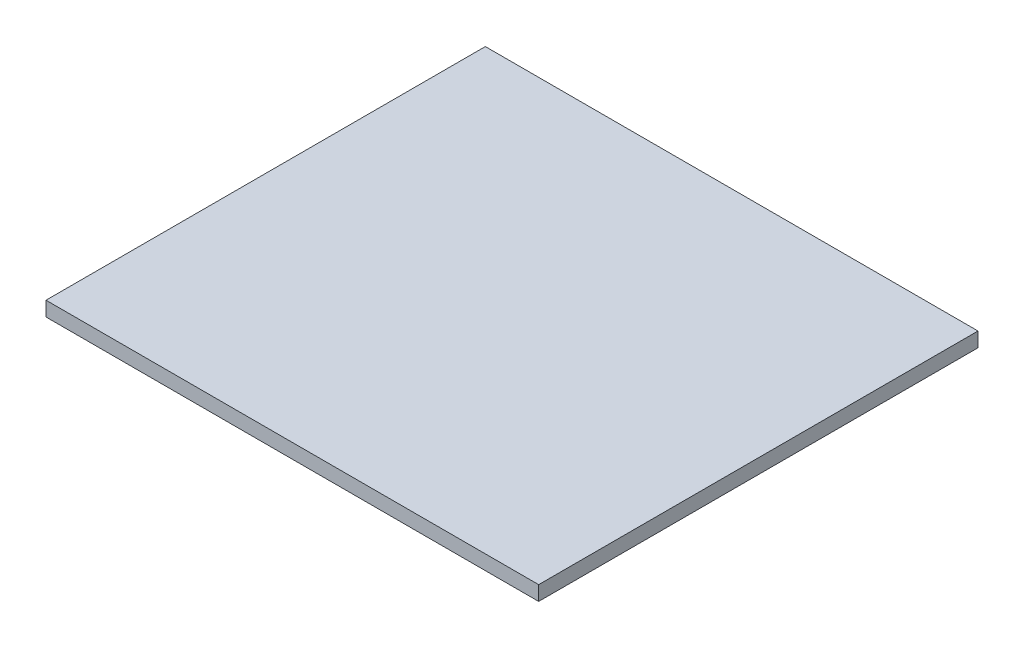
ISO-10303-21;
HEADER;
FILE_DESCRIPTION(('STEP AP214'),'2;1');
FILE_NAME('part.step','',(''),(''),'','','');
FILE_SCHEMA(('AUTOMOTIVE_DESIGN { 1 0 10303 214 1 1 1 1 }'));
ENDSEC;
DATA;
#1=APPLICATION_CONTEXT('core data for automotive mechanical design processes');
#2=APPLICATION_PROTOCOL_DEFINITION('international standard','automotive_design',2000,#1);
#3=PRODUCT_CONTEXT('',#1,'mechanical');
#4=PRODUCT('Part','Part','',(#3));
#5=PRODUCT_RELATED_PRODUCT_CATEGORY('part','',(#4));
#6=PRODUCT_DEFINITION_FORMATION('','',#4);
#7=PRODUCT_DEFINITION_CONTEXT('part definition',#1,'design');
#8=PRODUCT_DEFINITION('design','',#6,#7);
#9=PRODUCT_DEFINITION_SHAPE('','',#8);
#10=(LENGTH_UNIT() NAMED_UNIT(*) SI_UNIT(.MILLI.,.METRE.));
#11=(NAMED_UNIT(*) PLANE_ANGLE_UNIT() SI_UNIT($,.RADIAN.));
#12=(NAMED_UNIT(*) SI_UNIT($,.STERADIAN.) SOLID_ANGLE_UNIT());
#13=UNCERTAINTY_MEASURE_WITH_UNIT(LENGTH_MEASURE(1.E-05),#10,'distance_accuracy_value','');
#14=(GEOMETRIC_REPRESENTATION_CONTEXT(3) GLOBAL_UNCERTAINTY_ASSIGNED_CONTEXT((#13)) GLOBAL_UNIT_ASSIGNED_CONTEXT((#10,
#11,#12)) REPRESENTATION_CONTEXT('',''));
#15=CARTESIAN_POINT('',(0.,0.,0.));
#16=DIRECTION('',(0.,0.,1.));
#17=DIRECTION('',(1.,0.,0.));
#18=AXIS2_PLACEMENT_3D('',#15,#16,#17);
#19=CARTESIAN_POINT('',(461.9,1.9,411.9));
#20=DIRECTION('',(-1.,0.,0.));
#21=DIRECTION('',(0.,0.,1.));
#22=AXIS2_PLACEMENT_3D('',#19,#20,#21);
#23=PLANE('',#22);
#24=DIRECTION('',(0.,-1.,0.));
#25=VECTOR('',#24,1.);
#26=CARTESIAN_POINT('',(461.9,1.9,411.9));
#27=LINE('',#26,#25);
#28=CARTESIAN_POINT('',(461.9,1.9,411.9));
#29=VERTEX_POINT('',#28);
#30=CARTESIAN_POINT('',(461.9,-25.4,411.9));
#31=VERTEX_POINT('',#30);
#32=EDGE_CURVE('E154',#29,#31,#27,.T.);
#33=ORIENTED_EDGE('',*,*,#32,.T.);
#34=DIRECTION('',(0.,0.,1.));
#35=VECTOR('',#34,1.);
#36=CARTESIAN_POINT('',(461.9,-25.4,411.9));
#37=LINE('',#36,#35);
#38=CARTESIAN_POINT('',(461.9,-25.4,-411.9));
#39=VERTEX_POINT('',#38);
#40=EDGE_CURVE('E139',#39,#31,#37,.T.);
#41=ORIENTED_EDGE('',*,*,#40,.F.);
#42=DIRECTION('',(0.,-1.,0.));
#43=VECTOR('',#42,1.);
#44=CARTESIAN_POINT('',(461.9,1.9,-411.9));
#45=LINE('',#44,#43);
#46=CARTESIAN_POINT('',(461.9,1.9,-411.9));
#47=VERTEX_POINT('',#46);
#48=EDGE_CURVE('E11',#47,#39,#45,.T.);
#49=ORIENTED_EDGE('',*,*,#48,.F.);
#50=DIRECTION('',(0.,0.,-1.));
#51=VECTOR('',#50,1.);
#52=CARTESIAN_POINT('',(461.9,1.9,411.9));
#53=LINE('',#52,#51);
#54=EDGE_CURVE('E145',#29,#47,#53,.T.);
#55=ORIENTED_EDGE('',*,*,#54,.F.);
#56=EDGE_LOOP('',(#33,#41,#49,#55));
#57=FACE_BOUND('',#56,.T.);
#58=ADVANCED_FACE('F35',(#57),#23,.F.);
#59=CARTESIAN_POINT('',(-461.9,1.9,-411.9));
#60=DIRECTION('',(0.,0.,1.));
#61=DIRECTION('',(1.,0.,0.));
#62=AXIS2_PLACEMENT_3D('',#59,#60,#61);
#63=PLANE('',#62);
#64=ORIENTED_EDGE('',*,*,#48,.T.);
#65=DIRECTION('',(1.,0.,0.));
#66=VECTOR('',#65,1.);
#67=CARTESIAN_POINT('',(-461.9,-25.4,-411.9));
#68=LINE('',#67,#66);
#69=CARTESIAN_POINT('',(-461.9,-25.4,-411.9));
#70=VERTEX_POINT('',#69);
#71=EDGE_CURVE('E136',#70,#39,#68,.T.);
#72=ORIENTED_EDGE('',*,*,#71,.F.);
#73=DIRECTION('',(0.,-1.,0.));
#74=VECTOR('',#73,1.);
#75=CARTESIAN_POINT('',(-461.9,1.9,-411.9));
#76=LINE('',#75,#74);
#77=CARTESIAN_POINT('',(-461.9,1.9,-411.9));
#78=VERTEX_POINT('',#77);
#79=EDGE_CURVE('E42',#78,#70,#76,.T.);
#80=ORIENTED_EDGE('',*,*,#79,.F.);
#81=DIRECTION('',(-1.,0.,0.));
#82=VECTOR('',#81,1.);
#83=CARTESIAN_POINT('',(-461.9,1.9,-411.9));
#84=LINE('',#83,#82);
#85=EDGE_CURVE('E148',#47,#78,#84,.T.);
#86=ORIENTED_EDGE('',*,*,#85,.F.);
#87=EDGE_LOOP('',(#64,#72,#80,#86));
#88=FACE_BOUND('',#87,.T.);
#89=ADVANCED_FACE('F165',(#88),#63,.F.);
#90=CARTESIAN_POINT('',(-461.9,1.9,411.9));
#91=DIRECTION('',(1.,0.,0.));
#92=DIRECTION('',(0.,0.,-1.));
#93=AXIS2_PLACEMENT_3D('',#90,#91,#92);
#94=PLANE('',#93);
#95=ORIENTED_EDGE('',*,*,#79,.T.);
#96=DIRECTION('',(0.,0.,-1.));
#97=VECTOR('',#96,1.);
#98=CARTESIAN_POINT('',(-461.9,-25.4,411.9));
#99=LINE('',#98,#97);
#100=CARTESIAN_POINT('',(-461.9,-25.4,411.9));
#101=VERTEX_POINT('',#100);
#102=EDGE_CURVE('E112',#101,#70,#99,.T.);
#103=ORIENTED_EDGE('',*,*,#102,.F.);
#104=DIRECTION('',(0.,-1.,0.));
#105=VECTOR('',#104,1.);
#106=CARTESIAN_POINT('',(-461.9,1.9,411.9));
#107=LINE('',#106,#105);
#108=CARTESIAN_POINT('',(-461.9,1.9,411.9));
#109=VERTEX_POINT('',#108);
#110=EDGE_CURVE('E156',#109,#101,#107,.T.);
#111=ORIENTED_EDGE('',*,*,#110,.F.);
#112=DIRECTION('',(0.,0.,1.));
#113=VECTOR('',#112,1.);
#114=CARTESIAN_POINT('',(-461.9,1.9,411.9));
#115=LINE('',#114,#113);
#116=EDGE_CURVE('E150',#78,#109,#115,.T.);
#117=ORIENTED_EDGE('',*,*,#116,.F.);
#118=EDGE_LOOP('',(#95,#103,#111,#117));
#119=FACE_BOUND('',#118,.T.);
#120=ADVANCED_FACE('F162',(#119),#94,.F.);
#121=CARTESIAN_POINT('',(-461.9,1.9,411.9));
#122=DIRECTION('',(0.,0.,-1.));
#123=DIRECTION('',(-1.,0.,0.));
#124=AXIS2_PLACEMENT_3D('',#121,#122,#123);
#125=PLANE('',#124);
#126=ORIENTED_EDGE('',*,*,#110,.T.);
#127=DIRECTION('',(-1.,0.,0.));
#128=VECTOR('',#127,1.);
#129=CARTESIAN_POINT('',(-461.9,-25.4,411.9));
#130=LINE('',#129,#128);
#131=EDGE_CURVE('E142',#31,#101,#130,.T.);
#132=ORIENTED_EDGE('',*,*,#131,.F.);
#133=ORIENTED_EDGE('',*,*,#32,.F.);
#134=DIRECTION('',(1.,0.,0.));
#135=VECTOR('',#134,1.);
#136=CARTESIAN_POINT('',(-461.9,1.9,411.9));
#137=LINE('',#136,#135);
#138=EDGE_CURVE('E152',#109,#29,#137,.T.);
#139=ORIENTED_EDGE('',*,*,#138,.F.);
#140=EDGE_LOOP('',(#126,#132,#133,#139));
#141=FACE_BOUND('',#140,.T.);
#142=ADVANCED_FACE('F172',(#141),#125,.F.);
#143=CARTESIAN_POINT('',(0.,1.9,0.));
#144=DIRECTION('',(0.,-1.,0.));
#145=DIRECTION('',(0.,0.,-1.));
#146=AXIS2_PLACEMENT_3D('',#143,#144,#145);
#147=PLANE('',#146);
#148=ORIENTED_EDGE('',*,*,#54,.T.);
#149=ORIENTED_EDGE('',*,*,#85,.T.);
#150=ORIENTED_EDGE('',*,*,#116,.T.);
#151=ORIENTED_EDGE('',*,*,#138,.T.);
#152=EDGE_LOOP('',(#148,#149,#150,#151));
#153=FACE_BOUND('',#152,.T.);
#154=ADVANCED_FACE('F176',(#153),#147,.F.);
#155=CARTESIAN_POINT('',(0.,-25.4,0.));
#156=DIRECTION('',(0.,-1.,0.));
#157=DIRECTION('',(0.,0.,-1.));
#158=AXIS2_PLACEMENT_3D('',#155,#156,#157);
#159=PLANE('',#158);
#160=ORIENTED_EDGE('',*,*,#102,.T.);
#161=ORIENTED_EDGE('',*,*,#71,.T.);
#162=ORIENTED_EDGE('',*,*,#40,.T.);
#163=ORIENTED_EDGE('',*,*,#131,.T.);
#164=EDGE_LOOP('',(#160,#161,#162,#163));
#165=FACE_BOUND('',#164,.T.);
#166=DIRECTION('',(0.,0.,-1.));
#167=VECTOR('',#166,1.);
#168=CARTESIAN_POINT('',(-460.,-25.4,410.));
#169=LINE('',#168,#167);
#170=CARTESIAN_POINT('',(-460.,-25.4,410.));
#171=VERTEX_POINT('',#170);
#172=CARTESIAN_POINT('',(-460.,-25.4,-410.));
#173=VERTEX_POINT('',#172);
#174=EDGE_CURVE('E106',#171,#173,#169,.T.);
#175=ORIENTED_EDGE('',*,*,#174,.F.);
#176=DIRECTION('',(-1.,0.,0.));
#177=VECTOR('',#176,1.);
#178=CARTESIAN_POINT('',(-460.,-25.4,410.));
#179=LINE('',#178,#177);
#180=CARTESIAN_POINT('',(460.,-25.4,410.));
#181=VERTEX_POINT('',#180);
#182=EDGE_CURVE('E97',#181,#171,#179,.T.);
#183=ORIENTED_EDGE('',*,*,#182,.F.);
#184=DIRECTION('',(0.,0.,1.));
#185=VECTOR('',#184,1.);
#186=CARTESIAN_POINT('',(460.,-25.4,410.));
#187=LINE('',#186,#185);
#188=CARTESIAN_POINT('',(460.,-25.4,-410.));
#189=VERTEX_POINT('',#188);
#190=EDGE_CURVE('E120',#189,#181,#187,.T.);
#191=ORIENTED_EDGE('',*,*,#190,.F.);
#192=DIRECTION('',(1.,0.,0.));
#193=VECTOR('',#192,1.);
#194=CARTESIAN_POINT('',(-460.,-25.4,-410.));
#195=LINE('',#194,#193);
#196=EDGE_CURVE('E118',#173,#189,#195,.T.);
#197=ORIENTED_EDGE('',*,*,#196,.F.);
#198=EDGE_LOOP('',(#175,#183,#191,#197));
#199=FACE_BOUND('',#198,.T.);
#200=ADVANCED_FACE('F116',(#165,#199),#159,.T.);
#201=CARTESIAN_POINT('',(-460.,-25.4,410.));
#202=DIRECTION('',(0.,0.,-1.));
#203=DIRECTION('',(-1.,0.,0.));
#204=AXIS2_PLACEMENT_3D('',#201,#202,#203);
#205=PLANE('',#204);
#206=DIRECTION('',(-1.,0.,0.));
#207=VECTOR('',#206,1.);
#208=CARTESIAN_POINT('',(-460.,0.,410.));
#209=LINE('',#208,#207);
#210=CARTESIAN_POINT('',(460.,0.,410.));
#211=VERTEX_POINT('',#210);
#212=CARTESIAN_POINT('',(-460.,0.,410.));
#213=VERTEX_POINT('',#212);
#214=EDGE_CURVE('E49',#211,#213,#209,.T.);
#215=ORIENTED_EDGE('',*,*,#214,.F.);
#216=DIRECTION('',(0.,1.,0.));
#217=VECTOR('',#216,1.);
#218=CARTESIAN_POINT('',(460.,-25.4,410.));
#219=LINE('',#218,#217);
#220=EDGE_CURVE('E102',#181,#211,#219,.T.);
#221=ORIENTED_EDGE('',*,*,#220,.F.);
#222=ORIENTED_EDGE('',*,*,#182,.T.);
#223=DIRECTION('',(0.,1.,0.));
#224=VECTOR('',#223,1.);
#225=CARTESIAN_POINT('',(-460.,-25.4,410.));
#226=LINE('',#225,#224);
#227=EDGE_CURVE('E100',#171,#213,#226,.T.);
#228=ORIENTED_EDGE('',*,*,#227,.T.);
#229=EDGE_LOOP('',(#215,#221,#222,#228));
#230=FACE_BOUND('',#229,.T.);
#231=ADVANCED_FACE('F99',(#230),#205,.T.);
#232=CARTESIAN_POINT('',(-460.,-25.4,410.));
#233=DIRECTION('',(1.,0.,0.));
#234=DIRECTION('',(0.,0.,-1.));
#235=AXIS2_PLACEMENT_3D('',#232,#233,#234);
#236=PLANE('',#235);
#237=DIRECTION('',(0.,0.,-1.));
#238=VECTOR('',#237,1.);
#239=CARTESIAN_POINT('',(-460.,0.,410.));
#240=LINE('',#239,#238);
#241=CARTESIAN_POINT('',(-460.,0.,-410.));
#242=VERTEX_POINT('',#241);
#243=EDGE_CURVE('E53',#213,#242,#240,.T.);
#244=ORIENTED_EDGE('',*,*,#243,.F.);
#245=ORIENTED_EDGE('',*,*,#227,.F.);
#246=ORIENTED_EDGE('',*,*,#174,.T.);
#247=DIRECTION('',(0.,1.,0.));
#248=VECTOR('',#247,1.);
#249=CARTESIAN_POINT('',(-460.,-25.4,-410.));
#250=LINE('',#249,#248);
#251=EDGE_CURVE('E113',#173,#242,#250,.T.);
#252=ORIENTED_EDGE('',*,*,#251,.T.);
#253=EDGE_LOOP('',(#244,#245,#246,#252));
#254=FACE_BOUND('',#253,.T.);
#255=ADVANCED_FACE('F110',(#254),#236,.T.);
#256=CARTESIAN_POINT('',(-460.,-25.4,-410.));
#257=DIRECTION('',(0.,0.,1.));
#258=DIRECTION('',(1.,0.,0.));
#259=AXIS2_PLACEMENT_3D('',#256,#257,#258);
#260=PLANE('',#259);
#261=DIRECTION('',(1.,0.,0.));
#262=VECTOR('',#261,1.);
#263=CARTESIAN_POINT('',(-460.,0.,-410.));
#264=LINE('',#263,#262);
#265=CARTESIAN_POINT('',(460.,0.,-410.));
#266=VERTEX_POINT('',#265);
#267=EDGE_CURVE('E126',#242,#266,#264,.T.);
#268=ORIENTED_EDGE('',*,*,#267,.F.);
#269=ORIENTED_EDGE('',*,*,#251,.F.);
#270=ORIENTED_EDGE('',*,*,#196,.T.);
#271=DIRECTION('',(0.,1.,0.));
#272=VECTOR('',#271,1.);
#273=CARTESIAN_POINT('',(460.,-25.4,-410.));
#274=LINE('',#273,#272);
#275=EDGE_CURVE('E130',#189,#266,#274,.T.);
#276=ORIENTED_EDGE('',*,*,#275,.T.);
#277=EDGE_LOOP('',(#268,#269,#270,#276));
#278=FACE_BOUND('',#277,.T.);
#279=ADVANCED_FACE('F201',(#278),#260,.T.);
#280=CARTESIAN_POINT('',(460.,-25.4,410.));
#281=DIRECTION('',(-1.,0.,0.));
#282=DIRECTION('',(0.,0.,1.));
#283=AXIS2_PLACEMENT_3D('',#280,#281,#282);
#284=PLANE('',#283);
#285=DIRECTION('',(0.,0.,1.));
#286=VECTOR('',#285,1.);
#287=CARTESIAN_POINT('',(460.,0.,410.));
#288=LINE('',#287,#286);
#289=EDGE_CURVE('E107',#266,#211,#288,.T.);
#290=ORIENTED_EDGE('',*,*,#289,.F.);
#291=ORIENTED_EDGE('',*,*,#275,.F.);
#292=ORIENTED_EDGE('',*,*,#190,.T.);
#293=ORIENTED_EDGE('',*,*,#220,.T.);
#294=EDGE_LOOP('',(#290,#291,#292,#293));
#295=FACE_BOUND('',#294,.T.);
#296=ADVANCED_FACE('F192',(#295),#284,.T.);
#297=CARTESIAN_POINT('',(0.,0.,0.));
#298=DIRECTION('',(0.,-1.,0.));
#299=DIRECTION('',(0.,0.,-1.));
#300=AXIS2_PLACEMENT_3D('',#297,#298,#299);
#301=PLANE('',#300);
#302=ORIENTED_EDGE('',*,*,#214,.T.);
#303=ORIENTED_EDGE('',*,*,#243,.T.);
#304=ORIENTED_EDGE('',*,*,#267,.T.);
#305=ORIENTED_EDGE('',*,*,#289,.T.);
#306=EDGE_LOOP('',(#302,#303,#304,#305));
#307=FACE_BOUND('',#306,.T.);
#308=ADVANCED_FACE('F189',(#307),#301,.T.);
#309=CLOSED_SHELL('',(#58,#89,#120,#142,#154,#200,#231,#255,#279,#296,#308));
#310=MANIFOLD_SOLID_BREP('B2',#309);
#311=ADVANCED_BREP_SHAPE_REPRESENTATION('',(#18,#310),#14);
#312=SHAPE_DEFINITION_REPRESENTATION(#9,#311);
ENDSEC;
END-ISO-10303-21;
